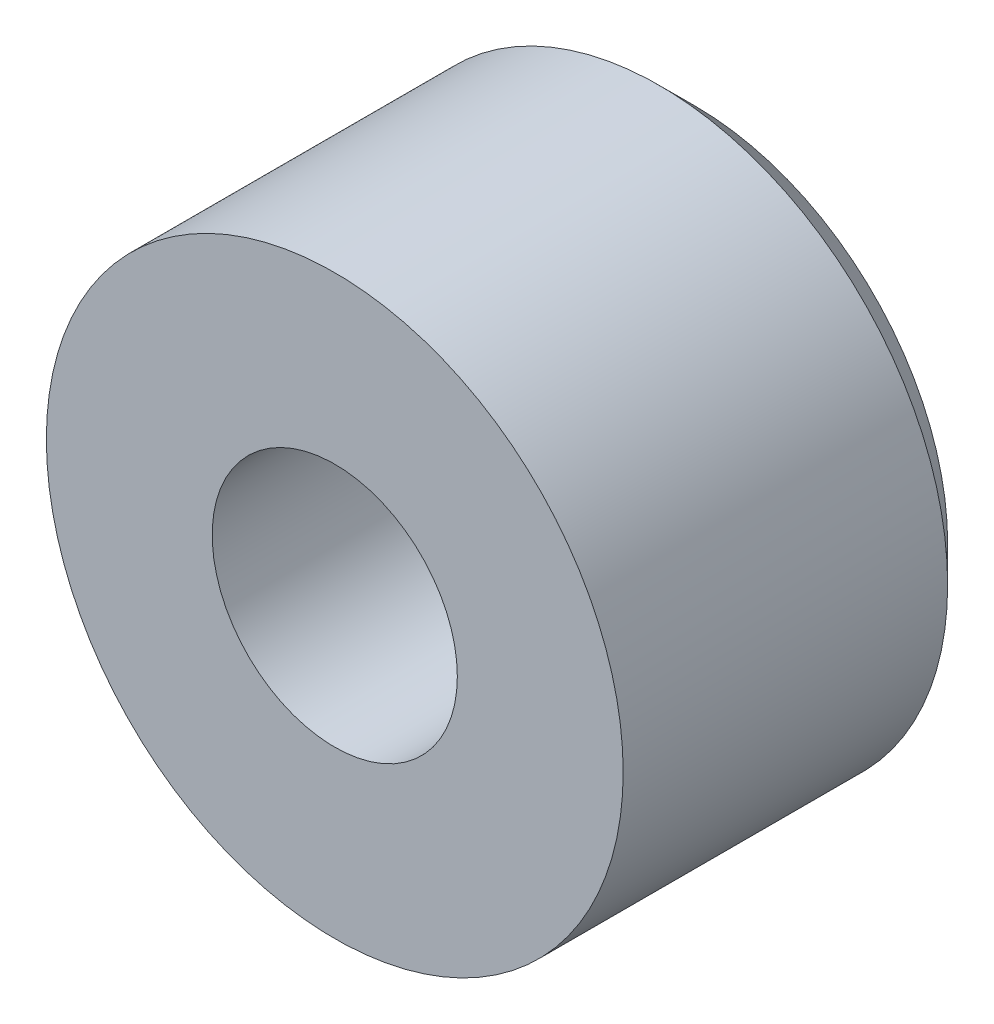
ISO-10303-21;
HEADER;
FILE_DESCRIPTION(('STEP AP214'),'2;1');
FILE_NAME('part.step','',(''),(''),'','','');
FILE_SCHEMA(('AUTOMOTIVE_DESIGN { 1 0 10303 214 1 1 1 1 }'));
ENDSEC;
DATA;
#1=APPLICATION_CONTEXT('core data for automotive mechanical design processes');
#2=APPLICATION_PROTOCOL_DEFINITION('international standard','automotive_design',2000,#1);
#3=PRODUCT_CONTEXT('',#1,'mechanical');
#4=PRODUCT('Part','Part','',(#3));
#5=PRODUCT_RELATED_PRODUCT_CATEGORY('part','',(#4));
#6=PRODUCT_DEFINITION_FORMATION('','',#4);
#7=PRODUCT_DEFINITION_CONTEXT('part definition',#1,'design');
#8=PRODUCT_DEFINITION('design','',#6,#7);
#9=PRODUCT_DEFINITION_SHAPE('','',#8);
#10=(LENGTH_UNIT() NAMED_UNIT(*) SI_UNIT(.MILLI.,.METRE.));
#11=(NAMED_UNIT(*) PLANE_ANGLE_UNIT() SI_UNIT($,.RADIAN.));
#12=(NAMED_UNIT(*) SI_UNIT($,.STERADIAN.) SOLID_ANGLE_UNIT());
#13=UNCERTAINTY_MEASURE_WITH_UNIT(LENGTH_MEASURE(1.E-05),#10,'distance_accuracy_value','');
#14=(GEOMETRIC_REPRESENTATION_CONTEXT(3) GLOBAL_UNCERTAINTY_ASSIGNED_CONTEXT((#13)) GLOBAL_UNIT_ASSIGNED_CONTEXT((#10,
#11,#12)) REPRESENTATION_CONTEXT('',''));
#15=CARTESIAN_POINT('',(0.,0.,0.));
#16=DIRECTION('',(0.,0.,1.));
#17=DIRECTION('',(1.,0.,0.));
#18=AXIS2_PLACEMENT_3D('',#15,#16,#17);
#19=CARTESIAN_POINT('',(0.,0.,5.));
#20=DIRECTION('',(0.,0.,1.));
#21=DIRECTION('',(1.,0.,0.));
#22=AXIS2_PLACEMENT_3D('',#19,#20,#21);
#23=PLANE('',#22);
#24=CARTESIAN_POINT('',(0.,0.,5.));
#25=DIRECTION('',(0.,0.,1.));
#26=DIRECTION('',(1.,0.,0.));
#27=AXIS2_PLACEMENT_3D('',#24,#25,#26);
#28=CIRCLE('',#27,4.);
#29=CARTESIAN_POINT('',(4.,0.,5.));
#30=VERTEX_POINT('',#29);
#31=EDGE_CURVE('E51',#30,#30,#28,.T.);
#32=ORIENTED_EDGE('',*,*,#31,.T.);
#33=EDGE_LOOP('',(#32));
#34=FACE_BOUND('',#33,.T.);
#35=CARTESIAN_POINT('',(0.,0.,5.));
#36=DIRECTION('',(0.,0.,1.));
#37=DIRECTION('',(1.,0.,0.));
#38=AXIS2_PLACEMENT_3D('',#35,#36,#37);
#39=CIRCLE('',#38,1.7);
#40=CARTESIAN_POINT('',(1.7,0.,5.));
#41=VERTEX_POINT('',#40);
#42=EDGE_CURVE('E54',#41,#41,#39,.T.);
#43=ORIENTED_EDGE('',*,*,#42,.F.);
#44=EDGE_LOOP('',(#43));
#45=FACE_BOUND('',#44,.T.);
#46=ADVANCED_FACE('F31',(#34,#45),#23,.T.);
#47=CARTESIAN_POINT('',(0.,0.,0.));
#48=DIRECTION('',(0.,0.,1.));
#49=DIRECTION('',(1.,0.,0.));
#50=AXIS2_PLACEMENT_3D('',#47,#48,#49);
#51=PLANE('',#50);
#52=CARTESIAN_POINT('',(0.,0.,0.));
#53=DIRECTION('',(0.,0.,1.));
#54=DIRECTION('',(1.,0.,0.));
#55=AXIS2_PLACEMENT_3D('',#52,#53,#54);
#56=CIRCLE('',#55,2.2);
#57=CARTESIAN_POINT('',(2.2,0.,0.));
#58=VERTEX_POINT('',#57);
#59=EDGE_CURVE('E42',#58,#58,#56,.T.);
#60=ORIENTED_EDGE('',*,*,#59,.T.);
#61=EDGE_LOOP('',(#60));
#62=FACE_BOUND('',#61,.T.);
#63=CARTESIAN_POINT('',(0.,0.,0.));
#64=DIRECTION('',(0.,0.,1.));
#65=DIRECTION('',(1.,0.,0.));
#66=AXIS2_PLACEMENT_3D('',#63,#64,#65);
#67=CIRCLE('',#66,3.5);
#68=CARTESIAN_POINT('',(3.5,0.,0.));
#69=VERTEX_POINT('',#68);
#70=EDGE_CURVE('E46',#69,#69,#67,.F.);
#71=ORIENTED_EDGE('',*,*,#70,.T.);
#72=EDGE_LOOP('',(#71));
#73=FACE_BOUND('',#72,.T.);
#74=ADVANCED_FACE('F61',(#62,#73),#51,.F.);
#75=CARTESIAN_POINT('',(0.,0.,5.));
#76=DIRECTION('',(0.,0.,-1.));
#77=DIRECTION('',(-1.,0.,0.));
#78=AXIS2_PLACEMENT_3D('',#75,#76,#77);
#79=CYLINDRICAL_SURFACE('',#78,4.);
#80=CARTESIAN_POINT('',(0.,0.,0.500000000000001));
#81=DIRECTION('',(0.,0.,1.));
#82=DIRECTION('',(1.,0.,0.));
#83=AXIS2_PLACEMENT_3D('',#80,#81,#82);
#84=CIRCLE('',#83,4.);
#85=CARTESIAN_POINT('',(4.,0.,0.500000000000001));
#86=VERTEX_POINT('',#85);
#87=EDGE_CURVE('E10',#86,#86,#84,.T.);
#88=ORIENTED_EDGE('',*,*,#87,.T.);
#89=EDGE_LOOP('',(#88));
#90=FACE_BOUND('',#89,.T.);
#91=ORIENTED_EDGE('',*,*,#31,.F.);
#92=EDGE_LOOP('',(#91));
#93=FACE_BOUND('',#92,.T.);
#94=ADVANCED_FACE('F68',(#90,#93),#79,.T.);
#95=CARTESIAN_POINT('',(0.,0.,5.));
#96=DIRECTION('',(0.,0.,-1.));
#97=DIRECTION('',(-1.,0.,0.));
#98=AXIS2_PLACEMENT_3D('',#95,#96,#97);
#99=CYLINDRICAL_SURFACE('',#98,1.7);
#100=CARTESIAN_POINT('',(0.,0.,0.500000000000003));
#101=DIRECTION('',(0.,0.,1.));
#102=DIRECTION('',(1.,0.,0.));
#103=AXIS2_PLACEMENT_3D('',#100,#101,#102);
#104=CIRCLE('',#103,1.7);
#105=CARTESIAN_POINT('',(1.7,0.,0.500000000000003));
#106=VERTEX_POINT('',#105);
#107=EDGE_CURVE('E38',#106,#106,#104,.F.);
#108=ORIENTED_EDGE('',*,*,#107,.T.);
#109=EDGE_LOOP('',(#108));
#110=FACE_BOUND('',#109,.T.);
#111=ORIENTED_EDGE('',*,*,#42,.T.);
#112=EDGE_LOOP('',(#111));
#113=FACE_BOUND('',#112,.T.);
#114=ADVANCED_FACE('F58',(#110,#113),#99,.F.);
#115=CARTESIAN_POINT('',(0.,0.,0.));
#116=DIRECTION('',(0.,0.,-1.));
#117=DIRECTION('',(-1.,0.,0.));
#118=AXIS2_PLACEMENT_3D('',#115,#116,#117);
#119=CONICAL_SURFACE('',#118,2.2,0.785398163397448);
#120=ORIENTED_EDGE('',*,*,#107,.F.);
#121=EDGE_LOOP('',(#120));
#122=FACE_BOUND('',#121,.T.);
#123=ORIENTED_EDGE('',*,*,#59,.F.);
#124=EDGE_LOOP('',(#123));
#125=FACE_BOUND('',#124,.T.);
#126=ADVANCED_FACE('F74',(#122,#125),#119,.F.);
#127=CARTESIAN_POINT('',(0.,0.,0.500000000000001));
#128=DIRECTION('',(0.,0.,1.));
#129=DIRECTION('',(1.,0.,0.));
#130=AXIS2_PLACEMENT_3D('',#127,#128,#129);
#131=CONICAL_SURFACE('',#130,4.,0.785398163397449);
#132=ORIENTED_EDGE('',*,*,#70,.F.);
#133=EDGE_LOOP('',(#132));
#134=FACE_BOUND('',#133,.T.);
#135=ORIENTED_EDGE('',*,*,#87,.F.);
#136=EDGE_LOOP('',(#135));
#137=FACE_BOUND('',#136,.T.);
#138=ADVANCED_FACE('F33',(#134,#137),#131,.T.);
#139=CLOSED_SHELL('',(#46,#74,#94,#114,#126,#138));
#140=MANIFOLD_SOLID_BREP('B2',#139);
#141=ADVANCED_BREP_SHAPE_REPRESENTATION('',(#18,#140),#14);
#142=SHAPE_DEFINITION_REPRESENTATION(#9,#141);
ENDSEC;
END-ISO-10303-21;
